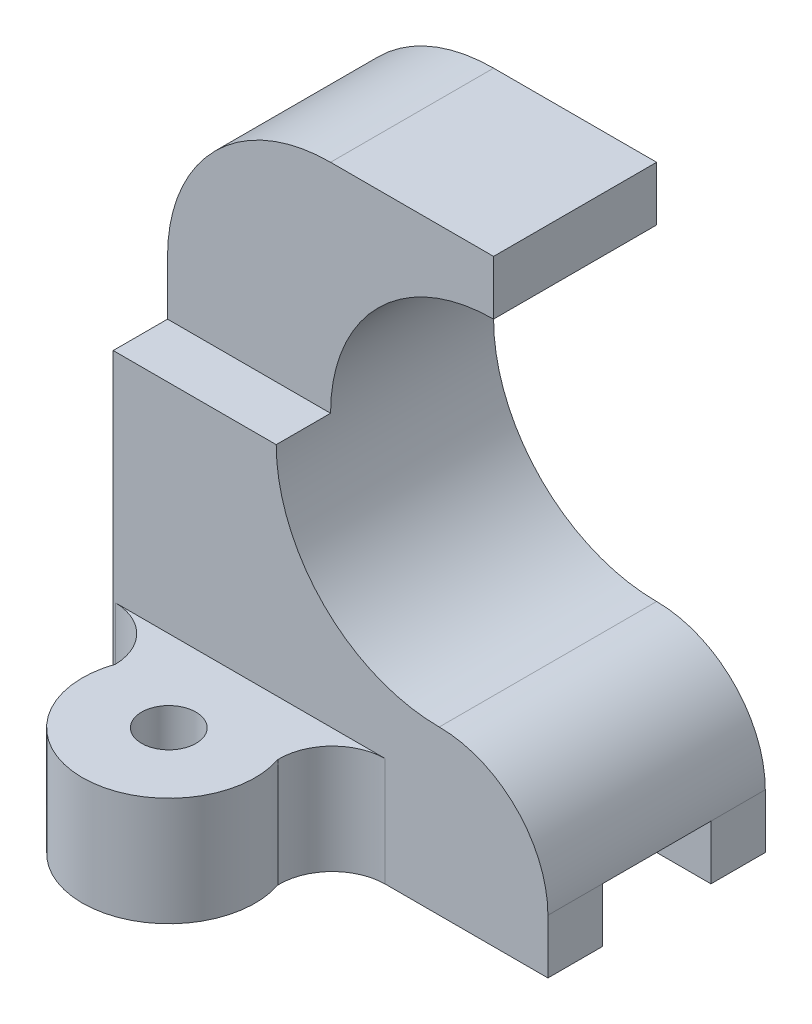
ISO-10303-21;
HEADER;
FILE_DESCRIPTION(('STEP AP214'),'2;1');
FILE_NAME('part.step','',(''),(''),'','','');
FILE_SCHEMA(('AUTOMOTIVE_DESIGN { 1 0 10303 214 1 1 1 1 }'));
ENDSEC;
DATA;
#1=APPLICATION_CONTEXT('core data for automotive mechanical design processes');
#2=APPLICATION_PROTOCOL_DEFINITION('international standard','automotive_design',2000,#1);
#3=PRODUCT_CONTEXT('',#1,'mechanical');
#4=PRODUCT('Part','Part','',(#3));
#5=PRODUCT_RELATED_PRODUCT_CATEGORY('part','',(#4));
#6=PRODUCT_DEFINITION_FORMATION('','',#4);
#7=PRODUCT_DEFINITION_CONTEXT('part definition',#1,'design');
#8=PRODUCT_DEFINITION('design','',#6,#7);
#9=PRODUCT_DEFINITION_SHAPE('','',#8);
#10=(LENGTH_UNIT() NAMED_UNIT(*) SI_UNIT(.MILLI.,.METRE.));
#11=(NAMED_UNIT(*) PLANE_ANGLE_UNIT() SI_UNIT($,.RADIAN.));
#12=(NAMED_UNIT(*) SI_UNIT($,.STERADIAN.) SOLID_ANGLE_UNIT());
#13=UNCERTAINTY_MEASURE_WITH_UNIT(LENGTH_MEASURE(1.E-05),#10,'distance_accuracy_value','');
#14=(GEOMETRIC_REPRESENTATION_CONTEXT(3) GLOBAL_UNCERTAINTY_ASSIGNED_CONTEXT((#13)) GLOBAL_UNIT_ASSIGNED_CONTEXT((#10,
#11,#12)) REPRESENTATION_CONTEXT('',''));
#15=CARTESIAN_POINT('',(0.,0.,0.));
#16=DIRECTION('',(0.,0.,1.));
#17=DIRECTION('',(1.,0.,0.));
#18=AXIS2_PLACEMENT_3D('',#15,#16,#17);
#19=CARTESIAN_POINT('',(-40.,100.,20.));
#20=DIRECTION('',(0.,0.,-1.));
#21=DIRECTION('',(-1.,0.,0.));
#22=AXIS2_PLACEMENT_3D('',#19,#20,#21);
#23=PLANE('',#22);
#24=DIRECTION('',(0.,-1.,0.));
#25=VECTOR('',#24,1.);
#26=CARTESIAN_POINT('',(-39.6001227021686,20.,20.));
#27=LINE('',#26,#25);
#28=CARTESIAN_POINT('',(-39.6001227021686,20.,20.));
#29=VERTEX_POINT('',#28);
#30=CARTESIAN_POINT('',(-39.6001227021686,0.,20.));
#31=VERTEX_POINT('',#30);
#32=EDGE_CURVE('E166',#29,#31,#27,.T.);
#33=ORIENTED_EDGE('',*,*,#32,.F.);
#34=DIRECTION('',(1.,0.,0.));
#35=VECTOR('',#34,1.);
#36=CARTESIAN_POINT('',(0.,20.,20.));
#37=LINE('',#36,#35);
#38=CARTESIAN_POINT('',(10.,20.,20.));
#39=VERTEX_POINT('',#38);
#40=EDGE_CURVE('E172',#29,#39,#37,.T.);
#41=ORIENTED_EDGE('',*,*,#40,.T.);
#42=DIRECTION('',(0.,-1.,0.));
#43=VECTOR('',#42,1.);
#44=CARTESIAN_POINT('',(10.,20.,20.));
#45=LINE('',#44,#43);
#46=CARTESIAN_POINT('',(10.,0.,20.));
#47=VERTEX_POINT('',#46);
#48=EDGE_CURVE('E158',#39,#47,#45,.T.);
#49=ORIENTED_EDGE('',*,*,#48,.T.);
#50=DIRECTION('',(1.,0.,0.));
#51=VECTOR('',#50,1.);
#52=CARTESIAN_POINT('',(-40.,0.,20.));
#53=LINE('',#52,#51);
#54=CARTESIAN_POINT('',(40.,0.,20.));
#55=VERTEX_POINT('',#54);
#56=EDGE_CURVE('E212',#47,#55,#53,.T.);
#57=ORIENTED_EDGE('',*,*,#56,.T.);
#58=DIRECTION('',(0.,-1.,0.));
#59=VECTOR('',#58,1.);
#60=CARTESIAN_POINT('',(40.,100.,20.));
#61=LINE('',#60,#59);
#62=CARTESIAN_POINT('',(40.,9.99999999999999,20.));
#63=VERTEX_POINT('',#62);
#64=EDGE_CURVE('E221',#63,#55,#61,.T.);
#65=ORIENTED_EDGE('',*,*,#64,.F.);
#66=CARTESIAN_POINT('',(20.,9.99999999999999,20.));
#67=DIRECTION('',(0.,0.,1.));
#68=DIRECTION('',(1.,0.,0.));
#69=AXIS2_PLACEMENT_3D('',#66,#67,#68);
#70=CIRCLE('',#69,20.);
#71=CARTESIAN_POINT('',(20.,30.,20.));
#72=VERTEX_POINT('',#71);
#73=EDGE_CURVE('E265',#63,#72,#70,.T.);
#74=ORIENTED_EDGE('',*,*,#73,.T.);
#75=CARTESIAN_POINT('',(20.,60.,20.));
#76=DIRECTION('',(0.,0.,1.));
#77=DIRECTION('',(1.,0.,0.));
#78=AXIS2_PLACEMENT_3D('',#75,#76,#77);
#79=CIRCLE('',#78,30.);
#80=CARTESIAN_POINT('',(-10.,60.,20.));
#81=VERTEX_POINT('',#80);
#82=EDGE_CURVE('E262',#72,#81,#79,.F.);
#83=ORIENTED_EDGE('',*,*,#82,.T.);
#84=DIRECTION('',(1.,0.,0.));
#85=VECTOR('',#84,1.);
#86=CARTESIAN_POINT('',(-80.,60.,20.));
#87=LINE('',#86,#85);
#88=CARTESIAN_POINT('',(-40.,60.,20.));
#89=VERTEX_POINT('',#88);
#90=EDGE_CURVE('E331',#89,#81,#87,.T.);
#91=ORIENTED_EDGE('',*,*,#90,.F.);
#92=DIRECTION('',(0.,-1.,0.));
#93=VECTOR('',#92,1.);
#94=CARTESIAN_POINT('',(-40.,100.,20.));
#95=LINE('',#94,#93);
#96=CARTESIAN_POINT('',(-40.,0.,20.));
#97=VERTEX_POINT('',#96);
#98=EDGE_CURVE('E225',#89,#97,#95,.T.);
#99=ORIENTED_EDGE('',*,*,#98,.T.);
#100=EDGE_CURVE('E215',#97,#31,#53,.T.);
#101=ORIENTED_EDGE('',*,*,#100,.T.);
#102=EDGE_LOOP('',(#33,#41,#49,#57,#65,#74,#83,#91,#99,#101));
#103=FACE_BOUND('',#102,.T.);
#104=ADVANCED_FACE('F34',(#103),#23,.F.);
#105=CARTESIAN_POINT('',(40.,100.,20.));
#106=DIRECTION('',(-1.,0.,0.));
#107=DIRECTION('',(0.,0.,1.));
#108=AXIS2_PLACEMENT_3D('',#105,#106,#107);
#109=PLANE('',#108);
#110=DIRECTION('',(0.,0.,-1.));
#111=VECTOR('',#110,1.);
#112=CARTESIAN_POINT('',(40.,0.,20.));
#113=LINE('',#112,#111);
#114=CARTESIAN_POINT('',(40.,0.,9.99999999999999));
#115=VERTEX_POINT('',#114);
#116=EDGE_CURVE('E290',#55,#115,#113,.T.);
#117=ORIENTED_EDGE('',*,*,#116,.T.);
#118=DIRECTION('',(0.,-1.,0.));
#119=VECTOR('',#118,1.);
#120=CARTESIAN_POINT('',(40.,0.,9.99999999999999));
#121=LINE('',#120,#119);
#122=CARTESIAN_POINT('',(40.,9.99999999999999,9.99999999999999));
#123=VERTEX_POINT('',#122);
#124=EDGE_CURVE('E341',#123,#115,#121,.T.);
#125=ORIENTED_EDGE('',*,*,#124,.F.);
#126=DIRECTION('',(0.,0.,1.));
#127=VECTOR('',#126,1.);
#128=CARTESIAN_POINT('',(40.,9.99999999999999,-80.));
#129=LINE('',#128,#127);
#130=EDGE_CURVE('E281',#123,#63,#129,.T.);
#131=ORIENTED_EDGE('',*,*,#130,.T.);
#132=ORIENTED_EDGE('',*,*,#64,.T.);
#133=EDGE_LOOP('',(#117,#125,#131,#132));
#134=FACE_BOUND('',#133,.T.);
#135=ADVANCED_FACE('F355',(#134),#109,.F.);
#136=CARTESIAN_POINT('',(0.,0.,0.));
#137=DIRECTION('',(0.,-1.,0.));
#138=DIRECTION('',(0.,0.,-1.));
#139=AXIS2_PLACEMENT_3D('',#136,#137,#138);
#140=PLANE('',#139);
#141=DIRECTION('',(1.,0.,0.));
#142=VECTOR('',#141,1.);
#143=CARTESIAN_POINT('',(-60.,0.,9.99999999999999));
#144=LINE('',#143,#142);
#145=CARTESIAN_POINT('',(-40.,0.,9.99999999999999));
#146=VERTEX_POINT('',#145);
#147=EDGE_CURVE('E313',#146,#115,#144,.T.);
#148=ORIENTED_EDGE('',*,*,#147,.T.);
#149=ORIENTED_EDGE('',*,*,#116,.F.);
#150=ORIENTED_EDGE('',*,*,#56,.F.);
#151=CARTESIAN_POINT('',(10.1308841835237,0.,29.797188152531));
#152=DIRECTION('',(0.,1.,0.));
#153=DIRECTION('',(0.,0.,1.));
#154=AXIS2_PLACEMENT_3D('',#151,#152,#153);
#155=CIRCLE('',#154,9.79806237812308);
#156=CARTESIAN_POINT('',(0.33492104965486,0.,30.));
#157=VERTEX_POINT('',#156);
#158=EDGE_CURVE('E51',#47,#157,#155,.T.);
#159=ORIENTED_EDGE('',*,*,#158,.T.);
#160=CARTESIAN_POINT('',(-14.7677374376418,0.,34.9982016956076));
#161=DIRECTION('',(0.,1.,0.));
#162=DIRECTION('',(0.,0.,1.));
#163=AXIS2_PLACEMENT_3D('',#160,#161,#162);
#164=CIRCLE('',#163,15.9082467158983);
#165=CARTESIAN_POINT('',(-29.8020603240454,0.,29.7980623781231));
#166=VERTEX_POINT('',#165);
#167=EDGE_CURVE('E189',#166,#157,#164,.T.);
#168=ORIENTED_EDGE('',*,*,#167,.F.);
#169=CARTESIAN_POINT('',(-39.8000613510842,0.,29.9980010270388));
#170=DIRECTION('',(0.,1.,0.));
#171=DIRECTION('',(0.,0.,1.));
#172=AXIS2_PLACEMENT_3D('',#169,#170,#171);
#173=CIRCLE('',#172,10.);
#174=EDGE_CURVE('E192',#31,#166,#173,.F.);
#175=ORIENTED_EDGE('',*,*,#174,.F.);
#176=ORIENTED_EDGE('',*,*,#100,.F.);
#177=DIRECTION('',(0.,0.,1.));
#178=VECTOR('',#177,1.);
#179=CARTESIAN_POINT('',(-40.,0.,20.));
#180=LINE('',#179,#178);
#181=EDGE_CURVE('E294',#146,#97,#180,.T.);
#182=ORIENTED_EDGE('',*,*,#181,.F.);
#183=EDGE_LOOP('',(#148,#149,#150,#159,#168,#175,#176,#182));
#184=FACE_BOUND('',#183,.T.);
#185=CARTESIAN_POINT('',(-14.7677374376418,0.,34.9982016956076));
#186=DIRECTION('',(0.,1.,0.));
#187=DIRECTION('',(0.,0.,1.));
#188=AXIS2_PLACEMENT_3D('',#185,#186,#187);
#189=CIRCLE('',#188,5.);
#190=CARTESIAN_POINT('',(-14.7677374376418,0.,39.9982016956076));
#191=VERTEX_POINT('',#190);
#192=EDGE_CURVE('E186',#191,#191,#189,.T.);
#193=ORIENTED_EDGE('',*,*,#192,.T.);
#194=EDGE_LOOP('',(#193));
#195=FACE_BOUND('',#194,.T.);
#196=ADVANCED_FACE('F327',(#184,#195),#140,.T.);
#197=CARTESIAN_POINT('',(-40.,100.,-20.));
#198=DIRECTION('',(0.,0.,1.));
#199=DIRECTION('',(1.,0.,0.));
#200=AXIS2_PLACEMENT_3D('',#197,#198,#199);
#201=PLANE('',#200);
#202=CARTESIAN_POINT('',(-10.,70.,-20.));
#203=DIRECTION('',(0.,0.,1.));
#204=DIRECTION('',(1.,0.,0.));
#205=AXIS2_PLACEMENT_3D('',#202,#203,#204);
#206=CIRCLE('',#205,30.);
#207=CARTESIAN_POINT('',(-10.,100.,-20.));
#208=VERTEX_POINT('',#207);
#209=CARTESIAN_POINT('',(-40.,70.,-20.));
#210=VERTEX_POINT('',#209);
#211=EDGE_CURVE('E257',#208,#210,#206,.T.);
#212=ORIENTED_EDGE('',*,*,#211,.F.);
#213=DIRECTION('',(-1.,0.,0.));
#214=VECTOR('',#213,1.);
#215=CARTESIAN_POINT('',(-40.,100.,-20.));
#216=LINE('',#215,#214);
#217=CARTESIAN_POINT('',(20.,100.,-20.));
#218=VERTEX_POINT('',#217);
#219=EDGE_CURVE('E226',#218,#208,#216,.T.);
#220=ORIENTED_EDGE('',*,*,#219,.F.);
#221=DIRECTION('',(0.,1.,0.));
#222=VECTOR('',#221,1.);
#223=CARTESIAN_POINT('',(20.,100.,-20.));
#224=LINE('',#223,#222);
#225=CARTESIAN_POINT('',(20.,90.,-20.));
#226=VERTEX_POINT('',#225);
#227=EDGE_CURVE('E277',#226,#218,#224,.T.);
#228=ORIENTED_EDGE('',*,*,#227,.F.);
#229=CARTESIAN_POINT('',(20.,60.,-20.));
#230=DIRECTION('',(0.,0.,1.));
#231=DIRECTION('',(1.,0.,0.));
#232=AXIS2_PLACEMENT_3D('',#229,#230,#231);
#233=CIRCLE('',#232,30.);
#234=CARTESIAN_POINT('',(20.,30.,-20.));
#235=VERTEX_POINT('',#234);
#236=EDGE_CURVE('E286',#235,#226,#233,.F.);
#237=ORIENTED_EDGE('',*,*,#236,.F.);
#238=CARTESIAN_POINT('',(20.,9.99999999999999,-20.));
#239=DIRECTION('',(0.,0.,1.));
#240=DIRECTION('',(1.,0.,0.));
#241=AXIS2_PLACEMENT_3D('',#238,#239,#240);
#242=CIRCLE('',#241,20.);
#243=CARTESIAN_POINT('',(40.,9.99999999999999,-20.));
#244=VERTEX_POINT('',#243);
#245=EDGE_CURVE('E284',#244,#235,#242,.T.);
#246=ORIENTED_EDGE('',*,*,#245,.F.);
#247=DIRECTION('',(0.,-1.,0.));
#248=VECTOR('',#247,1.);
#249=CARTESIAN_POINT('',(40.,100.,-20.));
#250=LINE('',#249,#248);
#251=CARTESIAN_POINT('',(40.,0.,-20.));
#252=VERTEX_POINT('',#251);
#253=EDGE_CURVE('E230',#244,#252,#250,.T.);
#254=ORIENTED_EDGE('',*,*,#253,.T.);
#255=DIRECTION('',(-1.,0.,0.));
#256=VECTOR('',#255,1.);
#257=CARTESIAN_POINT('',(-40.,0.,-20.));
#258=LINE('',#257,#256);
#259=CARTESIAN_POINT('',(-40.,0.,-20.));
#260=VERTEX_POINT('',#259);
#261=EDGE_CURVE('E292',#252,#260,#258,.T.);
#262=ORIENTED_EDGE('',*,*,#261,.T.);
#263=DIRECTION('',(0.,-1.,0.));
#264=VECTOR('',#263,1.);
#265=CARTESIAN_POINT('',(-40.,100.,-20.));
#266=LINE('',#265,#264);
#267=EDGE_CURVE('E228',#210,#260,#266,.T.);
#268=ORIENTED_EDGE('',*,*,#267,.F.);
#269=EDGE_LOOP('',(#212,#220,#228,#237,#246,#254,#262,#268));
#270=FACE_BOUND('',#269,.T.);
#271=ADVANCED_FACE('F372',(#270),#201,.F.);
#272=CARTESIAN_POINT('',(-40.,100.,20.));
#273=DIRECTION('',(1.,0.,0.));
#274=DIRECTION('',(0.,0.,-1.));
#275=AXIS2_PLACEMENT_3D('',#272,#273,#274);
#276=PLANE('',#275);
#277=DIRECTION('',(0.,0.,-1.));
#278=VECTOR('',#277,1.);
#279=CARTESIAN_POINT('',(-40.,60.,20.));
#280=LINE('',#279,#278);
#281=CARTESIAN_POINT('',(-40.,60.,9.99999999999999));
#282=VERTEX_POINT('',#281);
#283=EDGE_CURVE('E252',#89,#282,#280,.T.);
#284=ORIENTED_EDGE('',*,*,#283,.T.);
#285=DIRECTION('',(0.,1.,0.));
#286=VECTOR('',#285,1.);
#287=CARTESIAN_POINT('',(-40.,100.,9.99999999999999));
#288=LINE('',#287,#286);
#289=CARTESIAN_POINT('',(-40.,70.,9.99999999999999));
#290=VERTEX_POINT('',#289);
#291=EDGE_CURVE('E242',#282,#290,#288,.T.);
#292=ORIENTED_EDGE('',*,*,#291,.T.);
#293=DIRECTION('',(0.,0.,1.));
#294=VECTOR('',#293,1.);
#295=CARTESIAN_POINT('',(-40.,70.,-80.));
#296=LINE('',#295,#294);
#297=EDGE_CURVE('E236',#210,#290,#296,.T.);
#298=ORIENTED_EDGE('',*,*,#297,.F.);
#299=ORIENTED_EDGE('',*,*,#267,.T.);
#300=CARTESIAN_POINT('',(-40.,0.,-10.));
#301=VERTEX_POINT('',#300);
#302=EDGE_CURVE('E216',#260,#301,#180,.T.);
#303=ORIENTED_EDGE('',*,*,#302,.T.);
#304=DIRECTION('',(0.,1.,0.));
#305=VECTOR('',#304,1.);
#306=CARTESIAN_POINT('',(-40.,100.,-10.));
#307=LINE('',#306,#305);
#308=CARTESIAN_POINT('',(-40.,9.99999999999999,-10.));
#309=VERTEX_POINT('',#308);
#310=EDGE_CURVE('E304',#301,#309,#307,.T.);
#311=ORIENTED_EDGE('',*,*,#310,.T.);
#312=DIRECTION('',(0.,0.,1.));
#313=VECTOR('',#312,1.);
#314=CARTESIAN_POINT('',(-40.,9.99999999999999,20.));
#315=LINE('',#314,#313);
#316=CARTESIAN_POINT('',(-40.,9.99999999999999,9.99999999999999));
#317=VERTEX_POINT('',#316);
#318=EDGE_CURVE('E324',#309,#317,#315,.T.);
#319=ORIENTED_EDGE('',*,*,#318,.T.);
#320=DIRECTION('',(0.,-1.,0.));
#321=VECTOR('',#320,1.);
#322=CARTESIAN_POINT('',(-40.,100.,9.99999999999999));
#323=LINE('',#322,#321);
#324=EDGE_CURVE('E267',#317,#146,#323,.T.);
#325=ORIENTED_EDGE('',*,*,#324,.T.);
#326=ORIENTED_EDGE('',*,*,#181,.T.);
#327=ORIENTED_EDGE('',*,*,#98,.F.);
#328=EDGE_LOOP('',(#284,#292,#298,#299,#303,#311,#319,#325,#326,#327));
#329=FACE_BOUND('',#328,.T.);
#330=ADVANCED_FACE('F249',(#329),#276,.F.);
#331=CARTESIAN_POINT('',(0.,100.,0.));
#332=DIRECTION('',(0.,-1.,0.));
#333=DIRECTION('',(0.,0.,-1.));
#334=AXIS2_PLACEMENT_3D('',#331,#332,#333);
#335=PLANE('',#334);
#336=DIRECTION('',(0.,0.,1.));
#337=VECTOR('',#336,1.);
#338=CARTESIAN_POINT('',(-10.,100.,-80.));
#339=LINE('',#338,#337);
#340=CARTESIAN_POINT('',(-10.,100.,9.99999999999999));
#341=VERTEX_POINT('',#340);
#342=EDGE_CURVE('E258',#208,#341,#339,.T.);
#343=ORIENTED_EDGE('',*,*,#342,.T.);
#344=DIRECTION('',(1.,0.,0.));
#345=VECTOR('',#344,1.);
#346=CARTESIAN_POINT('',(-80.,100.,9.99999999999999));
#347=LINE('',#346,#345);
#348=CARTESIAN_POINT('',(20.,100.,9.99999999999999));
#349=VERTEX_POINT('',#348);
#350=EDGE_CURVE('E59',#341,#349,#347,.T.);
#351=ORIENTED_EDGE('',*,*,#350,.T.);
#352=DIRECTION('',(0.,0.,1.));
#353=VECTOR('',#352,1.);
#354=CARTESIAN_POINT('',(20.,100.,0.));
#355=LINE('',#354,#353);
#356=EDGE_CURVE('E233',#218,#349,#355,.T.);
#357=ORIENTED_EDGE('',*,*,#356,.F.);
#358=ORIENTED_EDGE('',*,*,#219,.T.);
#359=EDGE_LOOP('',(#343,#351,#357,#358));
#360=FACE_BOUND('',#359,.T.);
#361=ADVANCED_FACE('F375',(#360),#335,.F.);
#362=CARTESIAN_POINT('',(40.,9.99999999999999,-10.));
#363=VERTEX_POINT('',#362);
#364=EDGE_CURVE('E278',#244,#363,#129,.T.);
#365=ORIENTED_EDGE('',*,*,#364,.T.);
#366=DIRECTION('',(0.,1.,0.));
#367=VECTOR('',#366,1.);
#368=CARTESIAN_POINT('',(40.,0.,-10.));
#369=LINE('',#368,#367);
#370=CARTESIAN_POINT('',(40.,0.,-10.));
#371=VERTEX_POINT('',#370);
#372=EDGE_CURVE('E343',#371,#363,#369,.T.);
#373=ORIENTED_EDGE('',*,*,#372,.F.);
#374=EDGE_CURVE('E288',#371,#252,#113,.T.);
#375=ORIENTED_EDGE('',*,*,#374,.T.);
#376=ORIENTED_EDGE('',*,*,#253,.F.);
#377=EDGE_LOOP('',(#365,#373,#375,#376));
#378=FACE_BOUND('',#377,.T.);
#379=ADVANCED_FACE('F36',(#378),#109,.F.);
#380=DIRECTION('',(1.,0.,0.));
#381=VECTOR('',#380,1.);
#382=CARTESIAN_POINT('',(-60.,0.,-10.));
#383=LINE('',#382,#381);
#384=EDGE_CURVE('E309',#301,#371,#383,.T.);
#385=ORIENTED_EDGE('',*,*,#384,.F.);
#386=ORIENTED_EDGE('',*,*,#302,.F.);
#387=ORIENTED_EDGE('',*,*,#261,.F.);
#388=ORIENTED_EDGE('',*,*,#374,.F.);
#389=EDGE_LOOP('',(#385,#386,#387,#388));
#390=FACE_BOUND('',#389,.T.);
#391=ADVANCED_FACE('F307',(#390),#140,.T.);
#392=CARTESIAN_POINT('',(20.,60.,-80.));
#393=DIRECTION('',(0.,0.,1.));
#394=DIRECTION('',(1.,0.,0.));
#395=AXIS2_PLACEMENT_3D('',#392,#393,#394);
#396=CYLINDRICAL_SURFACE('',#395,30.);
#397=CARTESIAN_POINT('',(20.,60.,9.99999999999999));
#398=DIRECTION('',(0.,0.,-1.));
#399=DIRECTION('',(-1.,0.,0.));
#400=AXIS2_PLACEMENT_3D('',#397,#398,#399);
#401=CIRCLE('',#400,30.);
#402=CARTESIAN_POINT('',(-10.,60.,9.99999999999999));
#403=VERTEX_POINT('',#402);
#404=CARTESIAN_POINT('',(20.,90.,9.99999999999999));
#405=VERTEX_POINT('',#404);
#406=EDGE_CURVE('E253',#403,#405,#401,.T.);
#407=ORIENTED_EDGE('',*,*,#406,.F.);
#408=DIRECTION('',(0.,0.,1.));
#409=VECTOR('',#408,1.);
#410=CARTESIAN_POINT('',(-10.,60.,-80.));
#411=LINE('',#410,#409);
#412=EDGE_CURVE('E11',#81,#403,#411,.F.);
#413=ORIENTED_EDGE('',*,*,#412,.F.);
#414=ORIENTED_EDGE('',*,*,#82,.F.);
#415=DIRECTION('',(0.,0.,1.));
#416=VECTOR('',#415,1.);
#417=CARTESIAN_POINT('',(20.,30.,-80.));
#418=LINE('',#417,#416);
#419=EDGE_CURVE('E273',#235,#72,#418,.T.);
#420=ORIENTED_EDGE('',*,*,#419,.F.);
#421=ORIENTED_EDGE('',*,*,#236,.T.);
#422=DIRECTION('',(0.,0.,1.));
#423=VECTOR('',#422,1.);
#424=CARTESIAN_POINT('',(20.,90.,-80.));
#425=LINE('',#424,#423);
#426=EDGE_CURVE('E274',#226,#405,#425,.T.);
#427=ORIENTED_EDGE('',*,*,#426,.T.);
#428=EDGE_LOOP('',(#407,#413,#414,#420,#421,#427));
#429=FACE_BOUND('',#428,.T.);
#430=ADVANCED_FACE('F364',(#429),#396,.F.);
#431=CARTESIAN_POINT('',(20.,9.99999999999999,-80.));
#432=DIRECTION('',(0.,0.,1.));
#433=DIRECTION('',(1.,0.,0.));
#434=AXIS2_PLACEMENT_3D('',#431,#432,#433);
#435=CYLINDRICAL_SURFACE('',#434,20.);
#436=ORIENTED_EDGE('',*,*,#245,.T.);
#437=ORIENTED_EDGE('',*,*,#419,.T.);
#438=ORIENTED_EDGE('',*,*,#73,.F.);
#439=ORIENTED_EDGE('',*,*,#130,.F.);
#440=DIRECTION('',(0.,0.,1.));
#441=VECTOR('',#440,1.);
#442=CARTESIAN_POINT('',(40.,9.99999999999999,9.99999999999999));
#443=LINE('',#442,#441);
#444=EDGE_CURVE('E319',#363,#123,#443,.T.);
#445=ORIENTED_EDGE('',*,*,#444,.F.);
#446=ORIENTED_EDGE('',*,*,#364,.F.);
#447=EDGE_LOOP('',(#436,#437,#438,#439,#445,#446));
#448=FACE_BOUND('',#447,.T.);
#449=ADVANCED_FACE('F357',(#448),#435,.T.);
#450=CARTESIAN_POINT('',(20.,0.,-80.));
#451=DIRECTION('',(1.,0.,0.));
#452=DIRECTION('',(0.,0.,-1.));
#453=AXIS2_PLACEMENT_3D('',#450,#451,#452);
#454=PLANE('',#453);
#455=DIRECTION('',(0.,1.,0.));
#456=VECTOR('',#455,1.);
#457=CARTESIAN_POINT('',(20.,100.,9.99999999999999));
#458=LINE('',#457,#456);
#459=EDGE_CURVE('E165',#405,#349,#458,.T.);
#460=ORIENTED_EDGE('',*,*,#459,.F.);
#461=ORIENTED_EDGE('',*,*,#426,.F.);
#462=ORIENTED_EDGE('',*,*,#227,.T.);
#463=ORIENTED_EDGE('',*,*,#356,.T.);
#464=EDGE_LOOP('',(#460,#461,#462,#463));
#465=FACE_BOUND('',#464,.T.);
#466=ADVANCED_FACE('F369',(#465),#454,.T.);
#467=CARTESIAN_POINT('',(-10.,70.,-80.));
#468=DIRECTION('',(0.,0.,1.));
#469=DIRECTION('',(1.,0.,0.));
#470=AXIS2_PLACEMENT_3D('',#467,#468,#469);
#471=CYLINDRICAL_SURFACE('',#470,30.);
#472=CARTESIAN_POINT('',(-10.,70.,9.99999999999999));
#473=DIRECTION('',(0.,0.,-1.));
#474=DIRECTION('',(-1.,0.,0.));
#475=AXIS2_PLACEMENT_3D('',#472,#473,#474);
#476=CIRCLE('',#475,30.);
#477=EDGE_CURVE('E43',#341,#290,#476,.F.);
#478=ORIENTED_EDGE('',*,*,#477,.F.);
#479=ORIENTED_EDGE('',*,*,#342,.F.);
#480=ORIENTED_EDGE('',*,*,#211,.T.);
#481=ORIENTED_EDGE('',*,*,#297,.T.);
#482=EDGE_LOOP('',(#478,#479,#480,#481));
#483=FACE_BOUND('',#482,.T.);
#484=ADVANCED_FACE('F255',(#483),#471,.T.);
#485=CARTESIAN_POINT('',(-60.,0.,9.99999999999999));
#486=DIRECTION('',(0.,0.,1.));
#487=DIRECTION('',(1.,0.,0.));
#488=AXIS2_PLACEMENT_3D('',#485,#486,#487);
#489=PLANE('',#488);
#490=DIRECTION('',(1.,0.,0.));
#491=VECTOR('',#490,1.);
#492=CARTESIAN_POINT('',(-60.,9.99999999999999,9.99999999999999));
#493=LINE('',#492,#491);
#494=EDGE_CURVE('E316',#317,#123,#493,.T.);
#495=ORIENTED_EDGE('',*,*,#494,.T.);
#496=ORIENTED_EDGE('',*,*,#124,.T.);
#497=ORIENTED_EDGE('',*,*,#147,.F.);
#498=ORIENTED_EDGE('',*,*,#324,.F.);
#499=EDGE_LOOP('',(#495,#496,#497,#498));
#500=FACE_BOUND('',#499,.T.);
#501=ADVANCED_FACE('F346',(#500),#489,.F.);
#502=CARTESIAN_POINT('',(-60.,9.99999999999999,9.99999999999999));
#503=DIRECTION('',(0.,1.,0.));
#504=DIRECTION('',(0.,0.,1.));
#505=AXIS2_PLACEMENT_3D('',#502,#503,#504);
#506=PLANE('',#505);
#507=DIRECTION('',(1.,0.,0.));
#508=VECTOR('',#507,1.);
#509=CARTESIAN_POINT('',(-60.,9.99999999999999,-10.));
#510=LINE('',#509,#508);
#511=EDGE_CURVE('E312',#309,#363,#510,.T.);
#512=ORIENTED_EDGE('',*,*,#511,.T.);
#513=ORIENTED_EDGE('',*,*,#444,.T.);
#514=ORIENTED_EDGE('',*,*,#494,.F.);
#515=ORIENTED_EDGE('',*,*,#318,.F.);
#516=EDGE_LOOP('',(#512,#513,#514,#515));
#517=FACE_BOUND('',#516,.T.);
#518=ADVANCED_FACE('F350',(#517),#506,.F.);
#519=CARTESIAN_POINT('',(-60.,0.,-10.));
#520=DIRECTION('',(0.,0.,-1.));
#521=DIRECTION('',(-1.,0.,0.));
#522=AXIS2_PLACEMENT_3D('',#519,#520,#521);
#523=PLANE('',#522);
#524=ORIENTED_EDGE('',*,*,#384,.T.);
#525=ORIENTED_EDGE('',*,*,#372,.T.);
#526=ORIENTED_EDGE('',*,*,#511,.F.);
#527=ORIENTED_EDGE('',*,*,#310,.F.);
#528=EDGE_LOOP('',(#524,#525,#526,#527));
#529=FACE_BOUND('',#528,.T.);
#530=ADVANCED_FACE('F412',(#529),#523,.F.);
#531=CARTESIAN_POINT('',(-80.,60.,20.));
#532=DIRECTION('',(0.,-1.,0.));
#533=DIRECTION('',(0.,0.,-1.));
#534=AXIS2_PLACEMENT_3D('',#531,#532,#533);
#535=PLANE('',#534);
#536=ORIENTED_EDGE('',*,*,#90,.T.);
#537=ORIENTED_EDGE('',*,*,#412,.T.);
#538=DIRECTION('',(1.,0.,0.));
#539=VECTOR('',#538,1.);
#540=CARTESIAN_POINT('',(-80.,60.,9.99999999999999));
#541=LINE('',#540,#539);
#542=EDGE_CURVE('E335',#282,#403,#541,.T.);
#543=ORIENTED_EDGE('',*,*,#542,.F.);
#544=ORIENTED_EDGE('',*,*,#283,.F.);
#545=EDGE_LOOP('',(#536,#537,#543,#544));
#546=FACE_BOUND('',#545,.T.);
#547=ADVANCED_FACE('F365',(#546),#535,.F.);
#548=CARTESIAN_POINT('',(-80.,100.,9.99999999999999));
#549=DIRECTION('',(0.,0.,-1.));
#550=DIRECTION('',(-1.,0.,0.));
#551=AXIS2_PLACEMENT_3D('',#548,#549,#550);
#552=PLANE('',#551);
#553=ORIENTED_EDGE('',*,*,#406,.T.);
#554=ORIENTED_EDGE('',*,*,#459,.T.);
#555=ORIENTED_EDGE('',*,*,#350,.F.);
#556=ORIENTED_EDGE('',*,*,#477,.T.);
#557=ORIENTED_EDGE('',*,*,#291,.F.);
#558=ORIENTED_EDGE('',*,*,#542,.T.);
#559=EDGE_LOOP('',(#553,#554,#555,#556,#557,#558));
#560=FACE_BOUND('',#559,.T.);
#561=ADVANCED_FACE('F240',(#560),#552,.F.);
#562=CARTESIAN_POINT('',(10.1308841835237,20.,29.797188152531));
#563=DIRECTION('',(0.,-1.,0.));
#564=DIRECTION('',(0.,0.,-1.));
#565=AXIS2_PLACEMENT_3D('',#562,#563,#564);
#566=CYLINDRICAL_SURFACE('',#565,9.79806237812308);
#567=ORIENTED_EDGE('',*,*,#158,.F.);
#568=ORIENTED_EDGE('',*,*,#48,.F.);
#569=CARTESIAN_POINT('',(10.1308841835237,20.,29.797188152531));
#570=DIRECTION('',(0.,1.,0.));
#571=DIRECTION('',(0.,0.,1.));
#572=AXIS2_PLACEMENT_3D('',#569,#570,#571);
#573=CIRCLE('',#572,9.79806237812308);
#574=CARTESIAN_POINT('',(0.33492104965486,20.,30.));
#575=VERTEX_POINT('',#574);
#576=EDGE_CURVE('E161',#39,#575,#573,.T.);
#577=ORIENTED_EDGE('',*,*,#576,.T.);
#578=DIRECTION('',(0.,-1.,0.));
#579=VECTOR('',#578,1.);
#580=CARTESIAN_POINT('',(0.33492104965486,20.,30.));
#581=LINE('',#580,#579);
#582=EDGE_CURVE('E185',#575,#157,#581,.T.);
#583=ORIENTED_EDGE('',*,*,#582,.T.);
#584=EDGE_LOOP('',(#567,#568,#577,#583));
#585=FACE_BOUND('',#584,.T.);
#586=ADVANCED_FACE('F160',(#585),#566,.F.);
#587=CARTESIAN_POINT('',(-39.8000613510842,20.,29.9980010270388));
#588=DIRECTION('',(0.,-1.,0.));
#589=DIRECTION('',(0.,0.,-1.));
#590=AXIS2_PLACEMENT_3D('',#587,#588,#589);
#591=CYLINDRICAL_SURFACE('',#590,10.);
#592=ORIENTED_EDGE('',*,*,#174,.T.);
#593=DIRECTION('',(0.,-1.,0.));
#594=VECTOR('',#593,1.);
#595=CARTESIAN_POINT('',(-29.8020603240454,20.,29.7980623781231));
#596=LINE('',#595,#594);
#597=CARTESIAN_POINT('',(-29.8020603240454,20.,29.7980623781231));
#598=VERTEX_POINT('',#597);
#599=EDGE_CURVE('E194',#598,#166,#596,.T.);
#600=ORIENTED_EDGE('',*,*,#599,.F.);
#601=CARTESIAN_POINT('',(-39.8000613510842,20.,29.9980010270388));
#602=DIRECTION('',(0.,1.,0.));
#603=DIRECTION('',(0.,0.,1.));
#604=AXIS2_PLACEMENT_3D('',#601,#602,#603);
#605=CIRCLE('',#604,10.);
#606=EDGE_CURVE('E179',#29,#598,#605,.F.);
#607=ORIENTED_EDGE('',*,*,#606,.F.);
#608=ORIENTED_EDGE('',*,*,#32,.T.);
#609=EDGE_LOOP('',(#592,#600,#607,#608));
#610=FACE_BOUND('',#609,.T.);
#611=ADVANCED_FACE('F425',(#610),#591,.F.);
#612=CARTESIAN_POINT('',(-14.7677374376418,20.,34.9982016956076));
#613=DIRECTION('',(0.,-1.,0.));
#614=DIRECTION('',(0.,0.,-1.));
#615=AXIS2_PLACEMENT_3D('',#612,#613,#614);
#616=CYLINDRICAL_SURFACE('',#615,5.);
#617=CARTESIAN_POINT('',(-14.7677374376418,20.,34.9982016956076));
#618=DIRECTION('',(0.,1.,0.));
#619=DIRECTION('',(0.,0.,1.));
#620=AXIS2_PLACEMENT_3D('',#617,#618,#619);
#621=CIRCLE('',#620,5.);
#622=CARTESIAN_POINT('',(-14.7677374376418,20.,39.9982016956076));
#623=VERTEX_POINT('',#622);
#624=EDGE_CURVE('E176',#623,#623,#621,.T.);
#625=ORIENTED_EDGE('',*,*,#624,.T.);
#626=EDGE_LOOP('',(#625));
#627=FACE_BOUND('',#626,.T.);
#628=ORIENTED_EDGE('',*,*,#192,.F.);
#629=EDGE_LOOP('',(#628));
#630=FACE_BOUND('',#629,.T.);
#631=ADVANCED_FACE('F421',(#627,#630),#616,.F.);
#632=CARTESIAN_POINT('',(-14.7677374376418,20.,34.9982016956076));
#633=DIRECTION('',(0.,-1.,0.));
#634=DIRECTION('',(0.,0.,-1.));
#635=AXIS2_PLACEMENT_3D('',#632,#633,#634);
#636=CYLINDRICAL_SURFACE('',#635,15.9082467158983);
#637=ORIENTED_EDGE('',*,*,#167,.T.);
#638=ORIENTED_EDGE('',*,*,#582,.F.);
#639=CARTESIAN_POINT('',(-14.7677374376418,20.,34.9982016956076));
#640=DIRECTION('',(0.,1.,0.));
#641=DIRECTION('',(0.,0.,1.));
#642=AXIS2_PLACEMENT_3D('',#639,#640,#641);
#643=CIRCLE('',#642,15.9082467158983);
#644=EDGE_CURVE('E174',#598,#575,#643,.T.);
#645=ORIENTED_EDGE('',*,*,#644,.F.);
#646=ORIENTED_EDGE('',*,*,#599,.T.);
#647=EDGE_LOOP('',(#637,#638,#645,#646));
#648=FACE_BOUND('',#647,.T.);
#649=ADVANCED_FACE('F424',(#648),#636,.T.);
#650=CARTESIAN_POINT('',(0.,20.,0.));
#651=DIRECTION('',(0.,1.,0.));
#652=DIRECTION('',(0.,0.,1.));
#653=AXIS2_PLACEMENT_3D('',#650,#651,#652);
#654=PLANE('',#653);
#655=ORIENTED_EDGE('',*,*,#624,.F.);
#656=EDGE_LOOP('',(#655));
#657=FACE_BOUND('',#656,.T.);
#658=ORIENTED_EDGE('',*,*,#576,.F.);
#659=ORIENTED_EDGE('',*,*,#40,.F.);
#660=ORIENTED_EDGE('',*,*,#606,.T.);
#661=ORIENTED_EDGE('',*,*,#644,.T.);
#662=EDGE_LOOP('',(#658,#659,#660,#661));
#663=FACE_BOUND('',#662,.T.);
#664=ADVANCED_FACE('F170',(#657,#663),#654,.T.);
#665=CLOSED_SHELL('',(#104,#135,#196,#271,#330,#361,#379,#391,#430,#449,#466,#484,#501,#518,
#530,#547,#561,#586,#611,#631,#649,#664));
#666=MANIFOLD_SOLID_BREP('B2',#665);
#667=ADVANCED_BREP_SHAPE_REPRESENTATION('',(#18,#666),#14);
#668=SHAPE_DEFINITION_REPRESENTATION(#9,#667);
ENDSEC;
END-ISO-10303-21;
